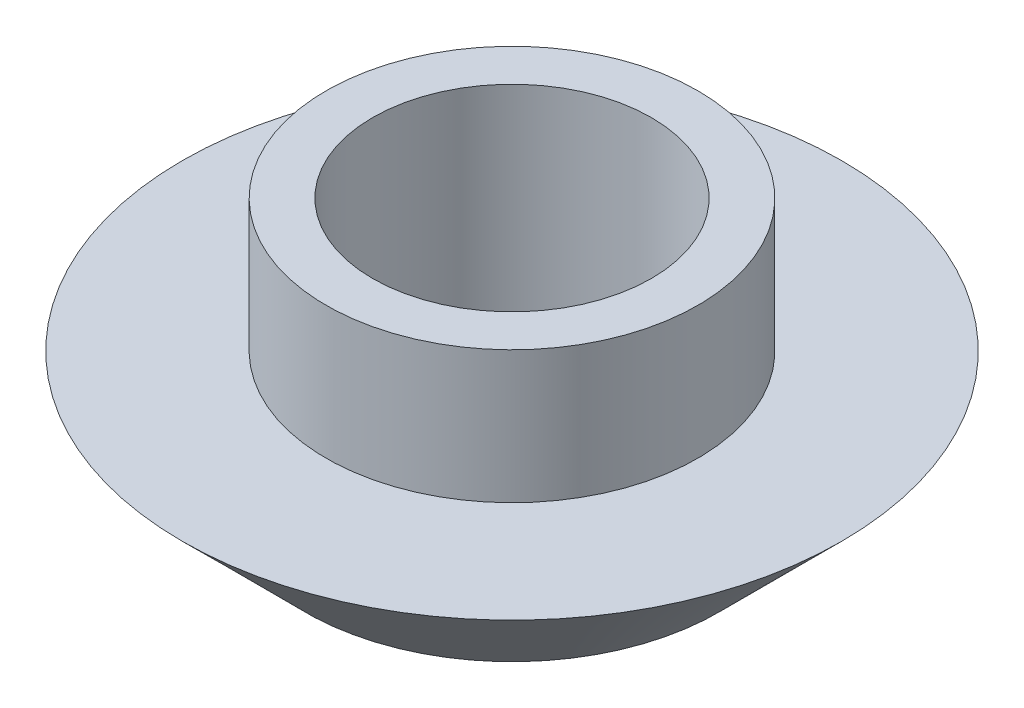
ISO-10303-21;
HEADER;
FILE_DESCRIPTION(('STEP AP214'),'2;1');
FILE_NAME('part.step','',(''),(''),'','','');
FILE_SCHEMA(('AUTOMOTIVE_DESIGN { 1 0 10303 214 1 1 1 1 }'));
ENDSEC;
DATA;
#1=APPLICATION_CONTEXT('core data for automotive mechanical design processes');
#2=APPLICATION_PROTOCOL_DEFINITION('international standard','automotive_design',2000,#1);
#3=PRODUCT_CONTEXT('',#1,'mechanical');
#4=PRODUCT('Part','Part','',(#3));
#5=PRODUCT_RELATED_PRODUCT_CATEGORY('part','',(#4));
#6=PRODUCT_DEFINITION_FORMATION('','',#4);
#7=PRODUCT_DEFINITION_CONTEXT('part definition',#1,'design');
#8=PRODUCT_DEFINITION('design','',#6,#7);
#9=PRODUCT_DEFINITION_SHAPE('','',#8);
#10=(LENGTH_UNIT() NAMED_UNIT(*) SI_UNIT(.MILLI.,.METRE.));
#11=(NAMED_UNIT(*) PLANE_ANGLE_UNIT() SI_UNIT($,.RADIAN.));
#12=(NAMED_UNIT(*) SI_UNIT($,.STERADIAN.) SOLID_ANGLE_UNIT());
#13=UNCERTAINTY_MEASURE_WITH_UNIT(LENGTH_MEASURE(1.E-05),#10,'distance_accuracy_value','');
#14=(GEOMETRIC_REPRESENTATION_CONTEXT(3) GLOBAL_UNCERTAINTY_ASSIGNED_CONTEXT((#13)) GLOBAL_UNIT_ASSIGNED_CONTEXT((#10,
#11,#12)) REPRESENTATION_CONTEXT('',''));
#15=CARTESIAN_POINT('',(0.,0.,0.));
#16=DIRECTION('',(0.,0.,1.));
#17=DIRECTION('',(1.,0.,0.));
#18=AXIS2_PLACEMENT_3D('',#15,#16,#17);
#19=CARTESIAN_POINT('',(4.45,0.,0.));
#20=DIRECTION('',(0.,-1.,0.));
#21=DIRECTION('',(0.,0.,-1.));
#22=AXIS2_PLACEMENT_3D('',#19,#20,#21);
#23=PLANE('',#22);
#24=CARTESIAN_POINT('',(0.,0.,0.));
#25=DIRECTION('',(0.,1.,0.));
#26=DIRECTION('',(0.,0.,1.));
#27=AXIS2_PLACEMENT_3D('',#24,#25,#26);
#28=CIRCLE('',#27,2.99999999999999);
#29=CARTESIAN_POINT('',(0.,0.,2.99999999999999));
#30=VERTEX_POINT('',#29);
#31=EDGE_CURVE('E51',#30,#30,#28,.T.);
#32=ORIENTED_EDGE('',*,*,#31,.T.);
#33=EDGE_LOOP('',(#32));
#34=FACE_BOUND('',#33,.T.);
#35=CARTESIAN_POINT('',(0.,0.,0.));
#36=DIRECTION('',(0.,-1.,0.));
#37=DIRECTION('',(0.,0.,-1.));
#38=AXIS2_PLACEMENT_3D('',#35,#36,#37);
#39=CIRCLE('',#38,4.45);
#40=CARTESIAN_POINT('',(0.,0.,-4.45));
#41=VERTEX_POINT('',#40);
#42=EDGE_CURVE('E46',#41,#41,#39,.T.);
#43=ORIENTED_EDGE('',*,*,#42,.T.);
#44=EDGE_LOOP('',(#43));
#45=FACE_BOUND('',#44,.T.);
#46=ADVANCED_FACE('F32',(#34,#45),#23,.T.);
#47=CARTESIAN_POINT('',(0.,5.495,0.));
#48=DIRECTION('',(0.,1.,0.));
#49=DIRECTION('',(0.,0.,1.));
#50=AXIS2_PLACEMENT_3D('',#47,#48,#49);
#51=PLANE('',#50);
#52=CARTESIAN_POINT('',(0.,5.495,0.));
#53=DIRECTION('',(0.,1.,0.));
#54=DIRECTION('',(0.,0.,1.));
#55=AXIS2_PLACEMENT_3D('',#52,#53,#54);
#56=CIRCLE('',#55,2.99999999999999);
#57=CARTESIAN_POINT('',(0.,5.495,2.99999999999999));
#58=VERTEX_POINT('',#57);
#59=EDGE_CURVE('E54',#58,#58,#56,.T.);
#60=ORIENTED_EDGE('',*,*,#59,.F.);
#61=EDGE_LOOP('',(#60));
#62=FACE_BOUND('',#61,.T.);
#63=CARTESIAN_POINT('',(0.,5.495,0.));
#64=DIRECTION('',(0.,-1.,0.));
#65=DIRECTION('',(0.,0.,-1.));
#66=AXIS2_PLACEMENT_3D('',#63,#64,#65);
#67=CIRCLE('',#66,4.);
#68=CARTESIAN_POINT('',(0.,5.495,-4.));
#69=VERTEX_POINT('',#68);
#70=EDGE_CURVE('E10',#69,#69,#67,.T.);
#71=ORIENTED_EDGE('',*,*,#70,.F.);
#72=EDGE_LOOP('',(#71));
#73=FACE_BOUND('',#72,.T.);
#74=ADVANCED_FACE('F60',(#62,#73),#51,.T.);
#75=CARTESIAN_POINT('',(0.,0.,0.));
#76=DIRECTION('',(0.,-1.,0.));
#77=DIRECTION('',(0.,0.,-1.));
#78=AXIS2_PLACEMENT_3D('',#75,#76,#77);
#79=CYLINDRICAL_SURFACE('',#78,4.);
#80=ORIENTED_EDGE('',*,*,#70,.T.);
#81=EDGE_LOOP('',(#80));
#82=FACE_BOUND('',#81,.T.);
#83=CARTESIAN_POINT('',(0.,2.645,0.));
#84=DIRECTION('',(0.,-1.,0.));
#85=DIRECTION('',(0.,0.,-1.));
#86=AXIS2_PLACEMENT_3D('',#83,#84,#85);
#87=CIRCLE('',#86,4.);
#88=CARTESIAN_POINT('',(0.,2.645,-4.));
#89=VERTEX_POINT('',#88);
#90=EDGE_CURVE('E38',#89,#89,#87,.T.);
#91=ORIENTED_EDGE('',*,*,#90,.F.);
#92=EDGE_LOOP('',(#91));
#93=FACE_BOUND('',#92,.T.);
#94=ADVANCED_FACE('F63',(#82,#93),#79,.T.);
#95=CARTESIAN_POINT('',(4.,2.645,0.));
#96=DIRECTION('',(0.,1.,0.));
#97=DIRECTION('',(0.,0.,1.));
#98=AXIS2_PLACEMENT_3D('',#95,#96,#97);
#99=PLANE('',#98);
#100=ORIENTED_EDGE('',*,*,#90,.T.);
#101=EDGE_LOOP('',(#100));
#102=FACE_BOUND('',#101,.T.);
#103=CARTESIAN_POINT('',(0.,2.645,0.));
#104=DIRECTION('',(0.,-1.,0.));
#105=DIRECTION('',(0.,0.,-1.));
#106=AXIS2_PLACEMENT_3D('',#103,#104,#105);
#107=CIRCLE('',#106,7.09500000000003);
#108=CARTESIAN_POINT('',(0.,2.645,-7.09500000000003));
#109=VERTEX_POINT('',#108);
#110=EDGE_CURVE('E42',#109,#109,#107,.T.);
#111=ORIENTED_EDGE('',*,*,#110,.F.);
#112=EDGE_LOOP('',(#111));
#113=FACE_BOUND('',#112,.T.);
#114=ADVANCED_FACE('F68',(#102,#113),#99,.T.);
#115=CARTESIAN_POINT('',(0.,0.,0.));
#116=DIRECTION('',(0.,1.,0.));
#117=DIRECTION('',(0.,0.,1.));
#118=AXIS2_PLACEMENT_3D('',#115,#116,#117);
#119=CONICAL_SURFACE('',#118,4.45,0.785398163397453);
#120=ORIENTED_EDGE('',*,*,#110,.T.);
#121=EDGE_LOOP('',(#120));
#122=FACE_BOUND('',#121,.T.);
#123=ORIENTED_EDGE('',*,*,#42,.F.);
#124=EDGE_LOOP('',(#123));
#125=FACE_BOUND('',#124,.T.);
#126=ADVANCED_FACE('F74',(#122,#125),#119,.T.);
#127=CARTESIAN_POINT('',(0.,5.495,0.));
#128=DIRECTION('',(0.,1.,0.));
#129=DIRECTION('',(0.,0.,1.));
#130=AXIS2_PLACEMENT_3D('',#127,#128,#129);
#131=CYLINDRICAL_SURFACE('',#130,2.99999999999999);
#132=ORIENTED_EDGE('',*,*,#31,.F.);
#133=EDGE_LOOP('',(#132));
#134=FACE_BOUND('',#133,.T.);
#135=ORIENTED_EDGE('',*,*,#59,.T.);
#136=EDGE_LOOP('',(#135));
#137=FACE_BOUND('',#136,.T.);
#138=ADVANCED_FACE('F58',(#134,#137),#131,.F.);
#139=CLOSED_SHELL('',(#46,#74,#94,#114,#126,#138));
#140=MANIFOLD_SOLID_BREP('B2',#139);
#141=ADVANCED_BREP_SHAPE_REPRESENTATION('',(#18,#140),#14);
#142=SHAPE_DEFINITION_REPRESENTATION(#9,#141);
ENDSEC;
END-ISO-10303-21;
